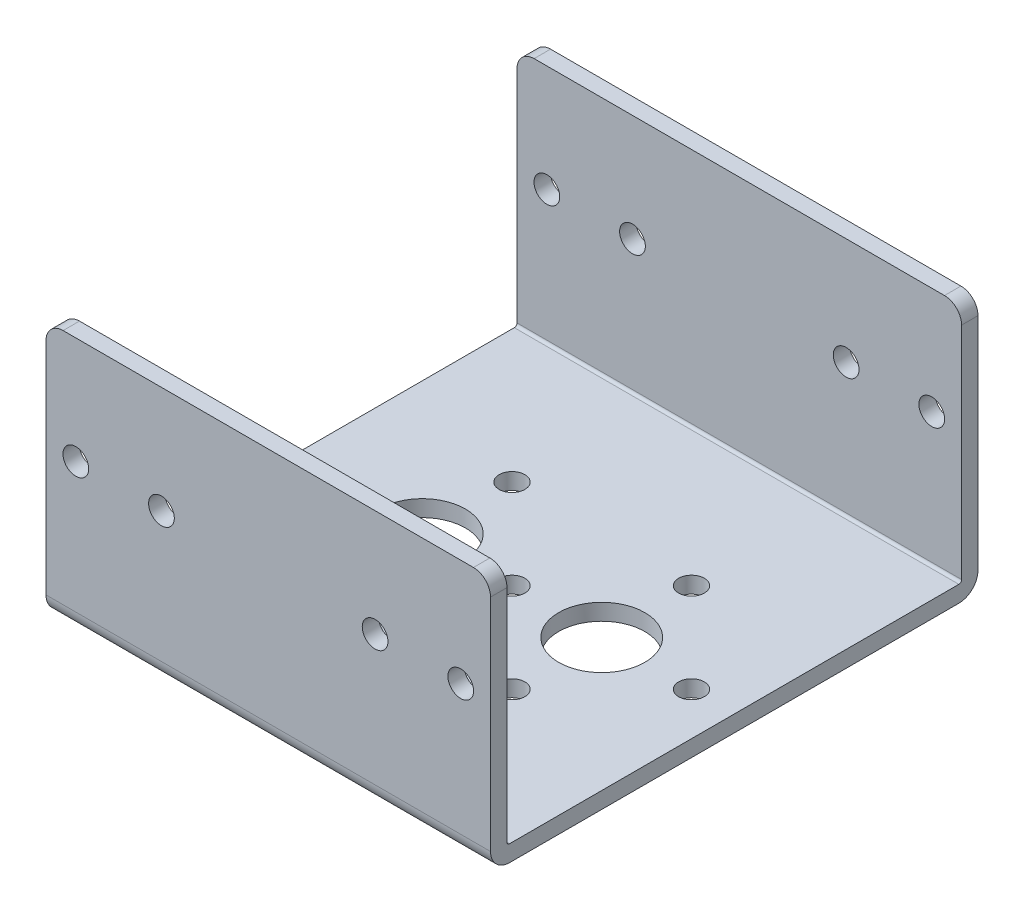
ISO-10303-21;
HEADER;
FILE_DESCRIPTION(('STEP AP214'),'2;1');
FILE_NAME('part.step','',(''),(''),'','','');
FILE_SCHEMA(('AUTOMOTIVE_DESIGN { 1 0 10303 214 1 1 1 1 }'));
ENDSEC;
DATA;
#1=APPLICATION_CONTEXT('core data for automotive mechanical design processes');
#2=APPLICATION_PROTOCOL_DEFINITION('international standard','automotive_design',2000,#1);
#3=PRODUCT_CONTEXT('',#1,'mechanical');
#4=PRODUCT('Part','Part','',(#3));
#5=PRODUCT_RELATED_PRODUCT_CATEGORY('part','',(#4));
#6=PRODUCT_DEFINITION_FORMATION('','',#4);
#7=PRODUCT_DEFINITION_CONTEXT('part definition',#1,'design');
#8=PRODUCT_DEFINITION('design','',#6,#7);
#9=PRODUCT_DEFINITION_SHAPE('','',#8);
#10=(LENGTH_UNIT() NAMED_UNIT(*) SI_UNIT(.MILLI.,.METRE.));
#11=(NAMED_UNIT(*) PLANE_ANGLE_UNIT() SI_UNIT($,.RADIAN.));
#12=(NAMED_UNIT(*) SI_UNIT($,.STERADIAN.) SOLID_ANGLE_UNIT());
#13=UNCERTAINTY_MEASURE_WITH_UNIT(LENGTH_MEASURE(1.E-05),#10,'distance_accuracy_value','');
#14=(GEOMETRIC_REPRESENTATION_CONTEXT(3) GLOBAL_UNCERTAINTY_ASSIGNED_CONTEXT((#13)) GLOBAL_UNIT_ASSIGNED_CONTEXT((#10,
#11,#12)) REPRESENTATION_CONTEXT('',''));
#15=CARTESIAN_POINT('',(0.,0.,0.));
#16=DIRECTION('',(0.,0.,1.));
#17=DIRECTION('',(1.,0.,0.));
#18=AXIS2_PLACEMENT_3D('',#15,#16,#17);
#19=CARTESIAN_POINT('',(20.6375,0.,20.85086));
#20=DIRECTION('',(0.,1.,0.));
#21=DIRECTION('',(0.,0.,1.));
#22=AXIS2_PLACEMENT_3D('',#19,#20,#21);
#23=PLANE('',#22);
#24=CARTESIAN_POINT('',(0.,0.,0.));
#25=DIRECTION('',(0.,1.,0.));
#26=DIRECTION('',(0.,0.,1.));
#27=AXIS2_PLACEMENT_3D('',#24,#25,#26);
#28=CIRCLE('',#27,1.1938);
#29=CARTESIAN_POINT('',(0.,0.,1.1938));
#30=VERTEX_POINT('',#29);
#31=EDGE_CURVE('E265',#30,#30,#28,.T.);
#32=ORIENTED_EDGE('',*,*,#31,.T.);
#33=EDGE_LOOP('',(#32));
#34=FACE_BOUND('',#33,.T.);
#35=CARTESIAN_POINT('',(8.3312,0.,8.3312));
#36=DIRECTION('',(0.,1.,0.));
#37=DIRECTION('',(0.,0.,1.));
#38=AXIS2_PLACEMENT_3D('',#35,#36,#37);
#39=CIRCLE('',#38,1.1938);
#40=CARTESIAN_POINT('',(8.3312,0.,9.525));
#41=VERTEX_POINT('',#40);
#42=EDGE_CURVE('E261',#41,#41,#39,.T.);
#43=ORIENTED_EDGE('',*,*,#42,.T.);
#44=EDGE_LOOP('',(#43));
#45=FACE_BOUND('',#44,.T.);
#46=CARTESIAN_POINT('',(-8.3312,0.,-8.33119999999999));
#47=DIRECTION('',(0.,1.,0.));
#48=DIRECTION('',(0.,0.,1.));
#49=AXIS2_PLACEMENT_3D('',#46,#47,#48);
#50=CIRCLE('',#49,1.1938);
#51=CARTESIAN_POINT('',(-8.3312,0.,-7.13739999999999));
#52=VERTEX_POINT('',#51);
#53=EDGE_CURVE('E249',#52,#52,#50,.F.);
#54=ORIENTED_EDGE('',*,*,#53,.F.);
#55=EDGE_LOOP('',(#54));
#56=FACE_BOUND('',#55,.T.);
#57=CARTESIAN_POINT('',(-8.3312,0.,0.));
#58=DIRECTION('',(0.,1.,0.));
#59=DIRECTION('',(0.,0.,1.));
#60=AXIS2_PLACEMENT_3D('',#57,#58,#59);
#61=CIRCLE('',#60,4.0005);
#62=CARTESIAN_POINT('',(-8.3312,0.,4.0005));
#63=VERTEX_POINT('',#62);
#64=EDGE_CURVE('E164',#63,#63,#61,.F.);
#65=ORIENTED_EDGE('',*,*,#64,.F.);
#66=EDGE_LOOP('',(#65));
#67=FACE_BOUND('',#66,.T.);
#68=DIRECTION('',(-1.,0.,0.));
#69=VECTOR('',#68,1.);
#70=CARTESIAN_POINT('',(20.6375,0.,20.85086));
#71=LINE('',#70,#69);
#72=CARTESIAN_POINT('',(20.6375,0.,20.85086));
#73=VERTEX_POINT('',#72);
#74=CARTESIAN_POINT('',(-20.6375,0.,20.85086));
#75=VERTEX_POINT('',#74);
#76=EDGE_CURVE('E140',#73,#75,#71,.T.);
#77=ORIENTED_EDGE('',*,*,#76,.T.);
#78=DIRECTION('',(0.,0.,-1.));
#79=VECTOR('',#78,1.);
#80=CARTESIAN_POINT('',(-20.6375,0.,20.85086));
#81=LINE('',#80,#79);
#82=CARTESIAN_POINT('',(-20.6375,0.,-20.85086));
#83=VERTEX_POINT('',#82);
#84=EDGE_CURVE('E144',#75,#83,#81,.T.);
#85=ORIENTED_EDGE('',*,*,#84,.T.);
#86=DIRECTION('',(-1.,0.,0.));
#87=VECTOR('',#86,1.);
#88=CARTESIAN_POINT('',(20.6375,0.,-20.85086));
#89=LINE('',#88,#87);
#90=CARTESIAN_POINT('',(20.6375,0.,-20.85086));
#91=VERTEX_POINT('',#90);
#92=EDGE_CURVE('E151',#91,#83,#89,.T.);
#93=ORIENTED_EDGE('',*,*,#92,.F.);
#94=DIRECTION('',(0.,0.,-1.));
#95=VECTOR('',#94,1.);
#96=CARTESIAN_POINT('',(20.6375,0.,20.85086));
#97=LINE('',#96,#95);
#98=EDGE_CURVE('E145',#73,#91,#97,.T.);
#99=ORIENTED_EDGE('',*,*,#98,.F.);
#100=EDGE_LOOP('',(#77,#85,#93,#99));
#101=FACE_BOUND('',#100,.T.);
#102=CARTESIAN_POINT('',(8.3312,0.,0.));
#103=DIRECTION('',(0.,1.,0.));
#104=DIRECTION('',(0.,0.,1.));
#105=AXIS2_PLACEMENT_3D('',#102,#103,#104);
#106=CIRCLE('',#105,4.0005);
#107=CARTESIAN_POINT('',(8.3312,0.,4.0005));
#108=VERTEX_POINT('',#107);
#109=EDGE_CURVE('E237',#108,#108,#106,.T.);
#110=ORIENTED_EDGE('',*,*,#109,.T.);
#111=EDGE_LOOP('',(#110));
#112=FACE_BOUND('',#111,.T.);
#113=CARTESIAN_POINT('',(16.6624,0.,0.));
#114=DIRECTION('',(0.,1.,0.));
#115=DIRECTION('',(0.,0.,1.));
#116=AXIS2_PLACEMENT_3D('',#113,#114,#115);
#117=CIRCLE('',#116,1.1938);
#118=CARTESIAN_POINT('',(16.6624,0.,1.1938));
#119=VERTEX_POINT('',#118);
#120=EDGE_CURVE('E241',#119,#119,#117,.T.);
#121=ORIENTED_EDGE('',*,*,#120,.T.);
#122=EDGE_LOOP('',(#121));
#123=FACE_BOUND('',#122,.T.);
#124=CARTESIAN_POINT('',(-16.6624,0.,0.));
#125=DIRECTION('',(0.,1.,0.));
#126=DIRECTION('',(0.,0.,1.));
#127=AXIS2_PLACEMENT_3D('',#124,#125,#126);
#128=CIRCLE('',#127,1.1938);
#129=CARTESIAN_POINT('',(-16.6624,0.,1.1938));
#130=VERTEX_POINT('',#129);
#131=EDGE_CURVE('E245',#130,#130,#128,.F.);
#132=ORIENTED_EDGE('',*,*,#131,.F.);
#133=EDGE_LOOP('',(#132));
#134=FACE_BOUND('',#133,.T.);
#135=CARTESIAN_POINT('',(8.3312,0.,-8.3312));
#136=DIRECTION('',(0.,1.,0.));
#137=DIRECTION('',(0.,0.,1.));
#138=AXIS2_PLACEMENT_3D('',#135,#136,#137);
#139=CIRCLE('',#138,1.1938);
#140=CARTESIAN_POINT('',(8.3312,0.,-7.1374));
#141=VERTEX_POINT('',#140);
#142=EDGE_CURVE('E253',#141,#141,#139,.T.);
#143=ORIENTED_EDGE('',*,*,#142,.T.);
#144=EDGE_LOOP('',(#143));
#145=FACE_BOUND('',#144,.T.);
#146=CARTESIAN_POINT('',(-8.3312,0.,8.33119999999999));
#147=DIRECTION('',(0.,1.,0.));
#148=DIRECTION('',(0.,0.,1.));
#149=AXIS2_PLACEMENT_3D('',#146,#147,#148);
#150=CIRCLE('',#149,1.1938);
#151=CARTESIAN_POINT('',(-8.3312,0.,9.52499999999999));
#152=VERTEX_POINT('',#151);
#153=EDGE_CURVE('E257',#152,#152,#150,.F.);
#154=ORIENTED_EDGE('',*,*,#153,.F.);
#155=EDGE_LOOP('',(#154));
#156=FACE_BOUND('',#155,.T.);
#157=ADVANCED_FACE('F26',(#34,#45,#56,#67,#101,#112,#123,#134,#145,#156),#23,.F.);
#158=CARTESIAN_POINT('',(20.6375,1.524,-20.85086));
#159=DIRECTION('',(0.,-1.,0.));
#160=DIRECTION('',(0.,0.,-1.));
#161=AXIS2_PLACEMENT_3D('',#158,#159,#160);
#162=PLANE('',#161);
#163=CARTESIAN_POINT('',(0.,1.524,0.));
#164=DIRECTION('',(0.,-1.,0.));
#165=DIRECTION('',(0.,0.,-1.));
#166=AXIS2_PLACEMENT_3D('',#163,#164,#165);
#167=CIRCLE('',#166,1.1938);
#168=CARTESIAN_POINT('',(0.,1.524,-1.1938));
#169=VERTEX_POINT('',#168);
#170=EDGE_CURVE('E266',#169,#169,#167,.T.);
#171=ORIENTED_EDGE('',*,*,#170,.T.);
#172=EDGE_LOOP('',(#171));
#173=FACE_BOUND('',#172,.T.);
#174=CARTESIAN_POINT('',(8.3312,1.524,8.3312));
#175=DIRECTION('',(0.,-1.,0.));
#176=DIRECTION('',(0.,0.,-1.));
#177=AXIS2_PLACEMENT_3D('',#174,#175,#176);
#178=CIRCLE('',#177,1.1938);
#179=CARTESIAN_POINT('',(8.3312,1.524,7.1374));
#180=VERTEX_POINT('',#179);
#181=EDGE_CURVE('E262',#180,#180,#178,.T.);
#182=ORIENTED_EDGE('',*,*,#181,.T.);
#183=EDGE_LOOP('',(#182));
#184=FACE_BOUND('',#183,.T.);
#185=CARTESIAN_POINT('',(-8.3312,1.524,-8.33119999999999));
#186=DIRECTION('',(0.,-1.,0.));
#187=DIRECTION('',(0.,0.,-1.));
#188=AXIS2_PLACEMENT_3D('',#185,#186,#187);
#189=CIRCLE('',#188,1.1938);
#190=CARTESIAN_POINT('',(-8.3312,1.524,-9.52499999999999));
#191=VERTEX_POINT('',#190);
#192=EDGE_CURVE('E250',#191,#191,#189,.F.);
#193=ORIENTED_EDGE('',*,*,#192,.F.);
#194=EDGE_LOOP('',(#193));
#195=FACE_BOUND('',#194,.T.);
#196=CARTESIAN_POINT('',(-8.3312,1.524,0.));
#197=DIRECTION('',(0.,-1.,0.));
#198=DIRECTION('',(0.,0.,-1.));
#199=AXIS2_PLACEMENT_3D('',#196,#197,#198);
#200=CIRCLE('',#199,4.0005);
#201=CARTESIAN_POINT('',(-8.3312,1.524,-4.0005));
#202=VERTEX_POINT('',#201);
#203=EDGE_CURVE('E167',#202,#202,#200,.F.);
#204=ORIENTED_EDGE('',*,*,#203,.F.);
#205=EDGE_LOOP('',(#204));
#206=FACE_BOUND('',#205,.T.);
#207=DIRECTION('',(-1.,0.,0.));
#208=VECTOR('',#207,1.);
#209=CARTESIAN_POINT('',(20.6375,1.524,-20.85086));
#210=LINE('',#209,#208);
#211=CARTESIAN_POINT('',(20.6375,1.524,-20.85086));
#212=VERTEX_POINT('',#211);
#213=CARTESIAN_POINT('',(-20.6375,1.524,-20.85086));
#214=VERTEX_POINT('',#213);
#215=EDGE_CURVE('E222',#212,#214,#210,.T.);
#216=ORIENTED_EDGE('',*,*,#215,.T.);
#217=DIRECTION('',(0.,0.,1.));
#218=VECTOR('',#217,1.);
#219=CARTESIAN_POINT('',(-20.6375,1.524,-20.85086));
#220=LINE('',#219,#218);
#221=CARTESIAN_POINT('',(-20.6375,1.524,20.85086));
#222=VERTEX_POINT('',#221);
#223=EDGE_CURVE('E179',#214,#222,#220,.T.);
#224=ORIENTED_EDGE('',*,*,#223,.T.);
#225=DIRECTION('',(-1.,0.,0.));
#226=VECTOR('',#225,1.);
#227=CARTESIAN_POINT('',(20.6375,1.524,20.85086));
#228=LINE('',#227,#226);
#229=CARTESIAN_POINT('',(20.6375,1.524,20.85086));
#230=VERTEX_POINT('',#229);
#231=EDGE_CURVE('E220',#230,#222,#228,.T.);
#232=ORIENTED_EDGE('',*,*,#231,.F.);
#233=DIRECTION('',(0.,0.,1.));
#234=VECTOR('',#233,1.);
#235=CARTESIAN_POINT('',(20.6375,1.524,-20.85086));
#236=LINE('',#235,#234);
#237=EDGE_CURVE('E202',#212,#230,#236,.T.);
#238=ORIENTED_EDGE('',*,*,#237,.F.);
#239=EDGE_LOOP('',(#216,#224,#232,#238));
#240=FACE_BOUND('',#239,.T.);
#241=CARTESIAN_POINT('',(8.3312,1.524,0.));
#242=DIRECTION('',(0.,-1.,0.));
#243=DIRECTION('',(0.,0.,-1.));
#244=AXIS2_PLACEMENT_3D('',#241,#242,#243);
#245=CIRCLE('',#244,4.0005);
#246=CARTESIAN_POINT('',(8.3312,1.524,-4.0005));
#247=VERTEX_POINT('',#246);
#248=EDGE_CURVE('E238',#247,#247,#245,.T.);
#249=ORIENTED_EDGE('',*,*,#248,.T.);
#250=EDGE_LOOP('',(#249));
#251=FACE_BOUND('',#250,.T.);
#252=CARTESIAN_POINT('',(16.6624,1.524,0.));
#253=DIRECTION('',(0.,-1.,0.));
#254=DIRECTION('',(0.,0.,-1.));
#255=AXIS2_PLACEMENT_3D('',#252,#253,#254);
#256=CIRCLE('',#255,1.1938);
#257=CARTESIAN_POINT('',(16.6624,1.524,-1.1938));
#258=VERTEX_POINT('',#257);
#259=EDGE_CURVE('E242',#258,#258,#256,.T.);
#260=ORIENTED_EDGE('',*,*,#259,.T.);
#261=EDGE_LOOP('',(#260));
#262=FACE_BOUND('',#261,.T.);
#263=CARTESIAN_POINT('',(-16.6624,1.524,0.));
#264=DIRECTION('',(0.,-1.,0.));
#265=DIRECTION('',(0.,0.,-1.));
#266=AXIS2_PLACEMENT_3D('',#263,#264,#265);
#267=CIRCLE('',#266,1.1938);
#268=CARTESIAN_POINT('',(-16.6624,1.524,-1.1938));
#269=VERTEX_POINT('',#268);
#270=EDGE_CURVE('E246',#269,#269,#267,.F.);
#271=ORIENTED_EDGE('',*,*,#270,.F.);
#272=EDGE_LOOP('',(#271));
#273=FACE_BOUND('',#272,.T.);
#274=CARTESIAN_POINT('',(8.3312,1.524,-8.3312));
#275=DIRECTION('',(0.,-1.,0.));
#276=DIRECTION('',(0.,0.,-1.));
#277=AXIS2_PLACEMENT_3D('',#274,#275,#276);
#278=CIRCLE('',#277,1.1938);
#279=CARTESIAN_POINT('',(8.3312,1.524,-9.525));
#280=VERTEX_POINT('',#279);
#281=EDGE_CURVE('E254',#280,#280,#278,.T.);
#282=ORIENTED_EDGE('',*,*,#281,.T.);
#283=EDGE_LOOP('',(#282));
#284=FACE_BOUND('',#283,.T.);
#285=CARTESIAN_POINT('',(-8.3312,1.524,8.33119999999999));
#286=DIRECTION('',(0.,-1.,0.));
#287=DIRECTION('',(0.,0.,-1.));
#288=AXIS2_PLACEMENT_3D('',#285,#286,#287);
#289=CIRCLE('',#288,1.1938);
#290=CARTESIAN_POINT('',(-8.3312,1.524,7.13739999999999));
#291=VERTEX_POINT('',#290);
#292=EDGE_CURVE('E258',#291,#291,#289,.F.);
#293=ORIENTED_EDGE('',*,*,#292,.F.);
#294=EDGE_LOOP('',(#293));
#295=FACE_BOUND('',#294,.T.);
#296=ADVANCED_FACE('F332',(#173,#184,#195,#206,#240,#251,#262,#273,#284,#295),#162,.F.);
#297=CARTESIAN_POINT('',(20.6375,1.778,20.85086));
#298=DIRECTION('',(-1.,0.,0.));
#299=DIRECTION('',(0.,0.,1.));
#300=AXIS2_PLACEMENT_3D('',#297,#298,#299);
#301=CYLINDRICAL_SURFACE('',#300,1.778);
#302=DIRECTION('',(-1.,0.,0.));
#303=VECTOR('',#302,1.);
#304=CARTESIAN_POINT('',(20.6375,1.77800000000001,22.62886));
#305=LINE('',#304,#303);
#306=CARTESIAN_POINT('',(20.6375,1.77800000000001,22.62886));
#307=VERTEX_POINT('',#306);
#308=CARTESIAN_POINT('',(-20.6375,1.77800000000001,22.62886));
#309=VERTEX_POINT('',#308);
#310=EDGE_CURVE('E163',#307,#309,#305,.T.);
#311=ORIENTED_EDGE('',*,*,#310,.T.);
#312=CARTESIAN_POINT('',(-20.6375,1.778,20.85086));
#313=DIRECTION('',(1.,0.,0.));
#314=DIRECTION('',(0.,0.,1.));
#315=AXIS2_PLACEMENT_3D('',#312,#313,#314);
#316=CIRCLE('',#315,1.778);
#317=EDGE_CURVE('E157',#309,#75,#316,.T.);
#318=ORIENTED_EDGE('',*,*,#317,.T.);
#319=ORIENTED_EDGE('',*,*,#76,.F.);
#320=CARTESIAN_POINT('',(20.6375,1.778,20.85086));
#321=DIRECTION('',(1.,0.,0.));
#322=DIRECTION('',(0.,0.,1.));
#323=AXIS2_PLACEMENT_3D('',#320,#321,#322);
#324=CIRCLE('',#323,1.778);
#325=EDGE_CURVE('E190',#307,#73,#324,.T.);
#326=ORIENTED_EDGE('',*,*,#325,.F.);
#327=EDGE_LOOP('',(#311,#318,#319,#326));
#328=FACE_BOUND('',#327,.T.);
#329=ADVANCED_FACE('F28',(#328),#301,.T.);
#330=CARTESIAN_POINT('',(20.6375,1.778,-20.85086));
#331=DIRECTION('',(-1.,0.,0.));
#332=DIRECTION('',(0.,0.,1.));
#333=AXIS2_PLACEMENT_3D('',#330,#331,#332);
#334=CYLINDRICAL_SURFACE('',#333,1.778);
#335=ORIENTED_EDGE('',*,*,#92,.T.);
#336=CARTESIAN_POINT('',(-20.6375,1.778,-20.85086));
#337=DIRECTION('',(1.,0.,0.));
#338=DIRECTION('',(0.,0.,1.));
#339=AXIS2_PLACEMENT_3D('',#336,#337,#338);
#340=CIRCLE('',#339,1.778);
#341=CARTESIAN_POINT('',(-20.6375,1.77800000000001,-22.62886));
#342=VERTEX_POINT('',#341);
#343=EDGE_CURVE('E159',#83,#342,#340,.T.);
#344=ORIENTED_EDGE('',*,*,#343,.T.);
#345=DIRECTION('',(-1.,0.,0.));
#346=VECTOR('',#345,1.);
#347=CARTESIAN_POINT('',(20.6375,1.77800000000001,-22.62886));
#348=LINE('',#347,#346);
#349=CARTESIAN_POINT('',(20.6375,1.77800000000001,-22.62886));
#350=VERTEX_POINT('',#349);
#351=EDGE_CURVE('E232',#350,#342,#348,.T.);
#352=ORIENTED_EDGE('',*,*,#351,.F.);
#353=CARTESIAN_POINT('',(20.6375,1.778,-20.85086));
#354=DIRECTION('',(1.,0.,0.));
#355=DIRECTION('',(0.,0.,1.));
#356=AXIS2_PLACEMENT_3D('',#353,#354,#355);
#357=CIRCLE('',#356,1.778);
#358=EDGE_CURVE('E193',#91,#350,#357,.T.);
#359=ORIENTED_EDGE('',*,*,#358,.F.);
#360=EDGE_LOOP('',(#335,#344,#352,#359));
#361=FACE_BOUND('',#360,.T.);
#362=ADVANCED_FACE('F358',(#361),#334,.T.);
#363=CARTESIAN_POINT('',(20.6375,1.77800000000001,-22.62886));
#364=DIRECTION('',(0.,0.,1.));
#365=DIRECTION('',(1.,0.,0.));
#366=AXIS2_PLACEMENT_3D('',#363,#364,#365);
#367=PLANE('',#366);
#368=CARTESIAN_POINT('',(17.8689,13.8938,-22.62886));
#369=DIRECTION('',(0.,0.,1.));
#370=DIRECTION('',(-1.,0.,0.));
#371=AXIS2_PLACEMENT_3D('',#368,#369,#370);
#372=CIRCLE('',#371,1.1938);
#373=CARTESIAN_POINT('',(16.6751,13.8938,-22.62886));
#374=VERTEX_POINT('',#373);
#375=EDGE_CURVE('E592',#374,#374,#372,.T.);
#376=ORIENTED_EDGE('',*,*,#375,.T.);
#377=EDGE_LOOP('',(#376));
#378=FACE_BOUND('',#377,.T.);
#379=CARTESIAN_POINT('',(9.9187,13.8938,-22.62886));
#380=DIRECTION('',(0.,0.,1.));
#381=DIRECTION('',(-1.,0.,0.));
#382=AXIS2_PLACEMENT_3D('',#379,#380,#381);
#383=CIRCLE('',#382,1.1938);
#384=CARTESIAN_POINT('',(8.7249,13.8938,-22.62886));
#385=VERTEX_POINT('',#384);
#386=EDGE_CURVE('E580',#385,#385,#383,.T.);
#387=ORIENTED_EDGE('',*,*,#386,.T.);
#388=EDGE_LOOP('',(#387));
#389=FACE_BOUND('',#388,.T.);
#390=CARTESIAN_POINT('',(-9.9187,13.8938,-22.62886));
#391=DIRECTION('',(0.,0.,1.));
#392=DIRECTION('',(1.,0.,0.));
#393=AXIS2_PLACEMENT_3D('',#390,#391,#392);
#394=CIRCLE('',#393,1.1938);
#395=CARTESIAN_POINT('',(-8.7249,13.8938,-22.62886));
#396=VERTEX_POINT('',#395);
#397=EDGE_CURVE('E568',#396,#396,#394,.T.);
#398=ORIENTED_EDGE('',*,*,#397,.T.);
#399=EDGE_LOOP('',(#398));
#400=FACE_BOUND('',#399,.T.);
#401=CARTESIAN_POINT('',(-17.8689,13.8938,-22.62886));
#402=DIRECTION('',(0.,0.,1.));
#403=DIRECTION('',(1.,0.,0.));
#404=AXIS2_PLACEMENT_3D('',#401,#402,#403);
#405=CIRCLE('',#404,1.1938);
#406=CARTESIAN_POINT('',(-16.6751,13.8938,-22.62886));
#407=VERTEX_POINT('',#406);
#408=EDGE_CURVE('E556',#407,#407,#405,.T.);
#409=ORIENTED_EDGE('',*,*,#408,.T.);
#410=EDGE_LOOP('',(#409));
#411=FACE_BOUND('',#410,.T.);
#412=DIRECTION('',(-1.,0.,0.));
#413=VECTOR('',#412,1.);
#414=CARTESIAN_POINT('',(20.6375,23.8252,-22.62886));
#415=LINE('',#414,#413);
#416=CARTESIAN_POINT('',(19.05,23.8252,-22.62886));
#417=VERTEX_POINT('',#416);
#418=CARTESIAN_POINT('',(-19.05,23.8252,-22.62886));
#419=VERTEX_POINT('',#418);
#420=EDGE_CURVE('E230',#417,#419,#415,.T.);
#421=ORIENTED_EDGE('',*,*,#420,.F.);
#422=CARTESIAN_POINT('',(19.05,22.2377,-22.62886));
#423=DIRECTION('',(0.,0.,1.));
#424=DIRECTION('',(1.,0.,0.));
#425=AXIS2_PLACEMENT_3D('',#422,#423,#424);
#426=CIRCLE('',#425,1.5875);
#427=CARTESIAN_POINT('',(20.6375,22.2377,-22.62886));
#428=VERTEX_POINT('',#427);
#429=EDGE_CURVE('E298',#417,#428,#426,.F.);
#430=ORIENTED_EDGE('',*,*,#429,.T.);
#431=DIRECTION('',(0.,1.,0.));
#432=VECTOR('',#431,1.);
#433=CARTESIAN_POINT('',(20.6375,1.77800000000001,-22.62886));
#434=LINE('',#433,#432);
#435=EDGE_CURVE('E195',#350,#428,#434,.T.);
#436=ORIENTED_EDGE('',*,*,#435,.F.);
#437=ORIENTED_EDGE('',*,*,#351,.T.);
#438=DIRECTION('',(0.,1.,0.));
#439=VECTOR('',#438,1.);
#440=CARTESIAN_POINT('',(-20.6375,1.77800000000001,-22.62886));
#441=LINE('',#440,#439);
#442=CARTESIAN_POINT('',(-20.6375,22.2377,-22.62886));
#443=VERTEX_POINT('',#442);
#444=EDGE_CURVE('E172',#342,#443,#441,.T.);
#445=ORIENTED_EDGE('',*,*,#444,.T.);
#446=CARTESIAN_POINT('',(-19.05,22.2377,-22.62886));
#447=DIRECTION('',(0.,0.,1.));
#448=DIRECTION('',(1.,0.,0.));
#449=AXIS2_PLACEMENT_3D('',#446,#447,#448);
#450=CIRCLE('',#449,1.5875);
#451=EDGE_CURVE('E47',#443,#419,#450,.F.);
#452=ORIENTED_EDGE('',*,*,#451,.T.);
#453=EDGE_LOOP('',(#421,#430,#436,#437,#445,#452));
#454=FACE_BOUND('',#453,.T.);
#455=ADVANCED_FACE('F301',(#378,#389,#400,#411,#454),#367,.F.);
#456=CARTESIAN_POINT('',(20.6375,23.8252,-22.62886));
#457=DIRECTION('',(0.,-1.,0.));
#458=DIRECTION('',(0.,0.,-1.));
#459=AXIS2_PLACEMENT_3D('',#456,#457,#458);
#460=PLANE('',#459);
#461=DIRECTION('',(-1.,0.,0.));
#462=VECTOR('',#461,1.);
#463=CARTESIAN_POINT('',(20.6375,23.8252,-21.10486));
#464=LINE('',#463,#462);
#465=CARTESIAN_POINT('',(19.05,23.8252,-21.10486));
#466=VERTEX_POINT('',#465);
#467=CARTESIAN_POINT('',(-19.05,23.8252,-21.10486));
#468=VERTEX_POINT('',#467);
#469=EDGE_CURVE('E227',#466,#468,#464,.T.);
#470=ORIENTED_EDGE('',*,*,#469,.F.);
#471=DIRECTION('',(0.,0.,1.));
#472=VECTOR('',#471,1.);
#473=CARTESIAN_POINT('',(19.05,23.8252,-22.62886));
#474=LINE('',#473,#472);
#475=EDGE_CURVE('E295',#466,#417,#474,.F.);
#476=ORIENTED_EDGE('',*,*,#475,.T.);
#477=ORIENTED_EDGE('',*,*,#420,.T.);
#478=DIRECTION('',(0.,0.,1.));
#479=VECTOR('',#478,1.);
#480=CARTESIAN_POINT('',(-19.05,23.8252,-21.10486));
#481=LINE('',#480,#479);
#482=EDGE_CURVE('E292',#419,#468,#481,.T.);
#483=ORIENTED_EDGE('',*,*,#482,.T.);
#484=EDGE_LOOP('',(#470,#476,#477,#483));
#485=FACE_BOUND('',#484,.T.);
#486=ADVANCED_FACE('F316',(#485),#460,.F.);
#487=CARTESIAN_POINT('',(20.6375,23.8252,-21.10486));
#488=DIRECTION('',(0.,0.,-1.));
#489=DIRECTION('',(-1.,0.,0.));
#490=AXIS2_PLACEMENT_3D('',#487,#488,#489);
#491=PLANE('',#490);
#492=CARTESIAN_POINT('',(17.8689,13.8938,-21.10486));
#493=DIRECTION('',(0.,0.,-1.));
#494=DIRECTION('',(-1.,0.,0.));
#495=AXIS2_PLACEMENT_3D('',#492,#493,#494);
#496=CIRCLE('',#495,1.1938);
#497=CARTESIAN_POINT('',(16.6751,13.8938,-21.10486));
#498=VERTEX_POINT('',#497);
#499=EDGE_CURVE('E586',#498,#498,#496,.T.);
#500=ORIENTED_EDGE('',*,*,#499,.T.);
#501=EDGE_LOOP('',(#500));
#502=FACE_BOUND('',#501,.T.);
#503=CARTESIAN_POINT('',(9.9187,13.8938,-21.10486));
#504=DIRECTION('',(0.,0.,-1.));
#505=DIRECTION('',(-1.,0.,0.));
#506=AXIS2_PLACEMENT_3D('',#503,#504,#505);
#507=CIRCLE('',#506,1.1938);
#508=CARTESIAN_POINT('',(8.7249,13.8938,-21.10486));
#509=VERTEX_POINT('',#508);
#510=EDGE_CURVE('E574',#509,#509,#507,.T.);
#511=ORIENTED_EDGE('',*,*,#510,.T.);
#512=EDGE_LOOP('',(#511));
#513=FACE_BOUND('',#512,.T.);
#514=CARTESIAN_POINT('',(-9.9187,13.8938,-21.10486));
#515=DIRECTION('',(0.,0.,-1.));
#516=DIRECTION('',(-1.,0.,0.));
#517=AXIS2_PLACEMENT_3D('',#514,#515,#516);
#518=CIRCLE('',#517,1.1938);
#519=CARTESIAN_POINT('',(-11.1125,13.8938,-21.10486));
#520=VERTEX_POINT('',#519);
#521=EDGE_CURVE('E562',#520,#520,#518,.T.);
#522=ORIENTED_EDGE('',*,*,#521,.T.);
#523=EDGE_LOOP('',(#522));
#524=FACE_BOUND('',#523,.T.);
#525=CARTESIAN_POINT('',(-17.8689,13.8938,-21.10486));
#526=DIRECTION('',(0.,0.,-1.));
#527=DIRECTION('',(-1.,0.,0.));
#528=AXIS2_PLACEMENT_3D('',#525,#526,#527);
#529=CIRCLE('',#528,1.1938);
#530=CARTESIAN_POINT('',(-19.0627,13.8938,-21.10486));
#531=VERTEX_POINT('',#530);
#532=EDGE_CURVE('E269',#531,#531,#529,.T.);
#533=ORIENTED_EDGE('',*,*,#532,.T.);
#534=EDGE_LOOP('',(#533));
#535=FACE_BOUND('',#534,.T.);
#536=DIRECTION('',(0.,-1.,0.));
#537=VECTOR('',#536,1.);
#538=CARTESIAN_POINT('',(20.6375,23.8252,-21.10486));
#539=LINE('',#538,#537);
#540=CARTESIAN_POINT('',(20.6375,22.2377,-21.10486));
#541=VERTEX_POINT('',#540);
#542=CARTESIAN_POINT('',(20.6375,1.77800000000001,-21.10486));
#543=VERTEX_POINT('',#542);
#544=EDGE_CURVE('E198',#541,#543,#539,.T.);
#545=ORIENTED_EDGE('',*,*,#544,.F.);
#546=CARTESIAN_POINT('',(19.05,22.2377,-21.10486));
#547=DIRECTION('',(0.,0.,-1.));
#548=DIRECTION('',(-1.,0.,0.));
#549=AXIS2_PLACEMENT_3D('',#546,#547,#548);
#550=CIRCLE('',#549,1.5875);
#551=EDGE_CURVE('E290',#541,#466,#550,.F.);
#552=ORIENTED_EDGE('',*,*,#551,.T.);
#553=ORIENTED_EDGE('',*,*,#469,.T.);
#554=CARTESIAN_POINT('',(-19.05,22.2377,-21.10486));
#555=DIRECTION('',(0.,0.,-1.));
#556=DIRECTION('',(-1.,0.,0.));
#557=AXIS2_PLACEMENT_3D('',#554,#555,#556);
#558=CIRCLE('',#557,1.5875);
#559=CARTESIAN_POINT('',(-20.6375,22.2377,-21.10486));
#560=VERTEX_POINT('',#559);
#561=EDGE_CURVE('E288',#468,#560,#558,.F.);
#562=ORIENTED_EDGE('',*,*,#561,.T.);
#563=DIRECTION('',(0.,-1.,0.));
#564=VECTOR('',#563,1.);
#565=CARTESIAN_POINT('',(-20.6375,23.8252,-21.10486));
#566=LINE('',#565,#564);
#567=CARTESIAN_POINT('',(-20.6375,1.77800000000001,-21.10486));
#568=VERTEX_POINT('',#567);
#569=EDGE_CURVE('E174',#560,#568,#566,.T.);
#570=ORIENTED_EDGE('',*,*,#569,.T.);
#571=DIRECTION('',(-1.,0.,0.));
#572=VECTOR('',#571,1.);
#573=CARTESIAN_POINT('',(20.6375,1.77800000000001,-21.10486));
#574=LINE('',#573,#572);
#575=EDGE_CURVE('E224',#543,#568,#574,.T.);
#576=ORIENTED_EDGE('',*,*,#575,.F.);
#577=EDGE_LOOP('',(#545,#552,#553,#562,#570,#576));
#578=FACE_BOUND('',#577,.T.);
#579=ADVANCED_FACE('F313',(#502,#513,#524,#535,#578),#491,.F.);
#580=CARTESIAN_POINT('',(20.6375,1.778,-20.85086));
#581=DIRECTION('',(-1.,0.,0.));
#582=DIRECTION('',(0.,0.,1.));
#583=AXIS2_PLACEMENT_3D('',#580,#581,#582);
#584=CYLINDRICAL_SURFACE('',#583,0.254);
#585=ORIENTED_EDGE('',*,*,#575,.T.);
#586=CARTESIAN_POINT('',(-20.6375,1.778,-20.85086));
#587=DIRECTION('',(-1.,0.,0.));
#588=DIRECTION('',(0.,0.,1.));
#589=AXIS2_PLACEMENT_3D('',#586,#587,#588);
#590=CIRCLE('',#589,0.254);
#591=EDGE_CURVE('E176',#568,#214,#590,.T.);
#592=ORIENTED_EDGE('',*,*,#591,.T.);
#593=ORIENTED_EDGE('',*,*,#215,.F.);
#594=CARTESIAN_POINT('',(20.6375,1.778,-20.85086));
#595=DIRECTION('',(-1.,0.,0.));
#596=DIRECTION('',(0.,0.,1.));
#597=AXIS2_PLACEMENT_3D('',#594,#595,#596);
#598=CIRCLE('',#597,0.254);
#599=EDGE_CURVE('E200',#543,#212,#598,.T.);
#600=ORIENTED_EDGE('',*,*,#599,.F.);
#601=EDGE_LOOP('',(#585,#592,#593,#600));
#602=FACE_BOUND('',#601,.T.);
#603=ADVANCED_FACE('F325',(#602),#584,.F.);
#604=CARTESIAN_POINT('',(20.6375,1.778,20.85086));
#605=DIRECTION('',(-1.,0.,0.));
#606=DIRECTION('',(0.,0.,1.));
#607=AXIS2_PLACEMENT_3D('',#604,#605,#606);
#608=CYLINDRICAL_SURFACE('',#607,0.254);
#609=ORIENTED_EDGE('',*,*,#231,.T.);
#610=CARTESIAN_POINT('',(-20.6375,1.778,20.85086));
#611=DIRECTION('',(-1.,0.,0.));
#612=DIRECTION('',(0.,0.,1.));
#613=AXIS2_PLACEMENT_3D('',#610,#611,#612);
#614=CIRCLE('',#613,0.254);
#615=CARTESIAN_POINT('',(-20.6375,1.778,21.10486));
#616=VERTEX_POINT('',#615);
#617=EDGE_CURVE('E182',#222,#616,#614,.T.);
#618=ORIENTED_EDGE('',*,*,#617,.T.);
#619=DIRECTION('',(-1.,0.,0.));
#620=VECTOR('',#619,1.);
#621=CARTESIAN_POINT('',(20.6375,1.778,21.10486));
#622=LINE('',#621,#620);
#623=CARTESIAN_POINT('',(20.6375,1.778,21.10486));
#624=VERTEX_POINT('',#623);
#625=EDGE_CURVE('E218',#624,#616,#622,.T.);
#626=ORIENTED_EDGE('',*,*,#625,.F.);
#627=CARTESIAN_POINT('',(20.6375,1.778,20.85086));
#628=DIRECTION('',(-1.,0.,0.));
#629=DIRECTION('',(0.,0.,1.));
#630=AXIS2_PLACEMENT_3D('',#627,#628,#629);
#631=CIRCLE('',#630,0.254);
#632=EDGE_CURVE('E204',#230,#624,#631,.T.);
#633=ORIENTED_EDGE('',*,*,#632,.F.);
#634=EDGE_LOOP('',(#609,#618,#626,#633));
#635=FACE_BOUND('',#634,.T.);
#636=ADVANCED_FACE('F335',(#635),#608,.F.);
#637=CARTESIAN_POINT('',(20.6375,23.8252,21.10486));
#638=DIRECTION('',(0.,0.,1.));
#639=DIRECTION('',(1.,0.,0.));
#640=AXIS2_PLACEMENT_3D('',#637,#638,#639);
#641=PLANE('',#640);
#642=CARTESIAN_POINT('',(17.8689,13.8938,21.10486));
#643=DIRECTION('',(0.,0.,1.));
#644=DIRECTION('',(1.,0.,0.));
#645=AXIS2_PLACEMENT_3D('',#642,#643,#644);
#646=CIRCLE('',#645,1.1938);
#647=CARTESIAN_POINT('',(19.0627,13.8938,21.10486));
#648=VERTEX_POINT('',#647);
#649=EDGE_CURVE('E589',#648,#648,#646,.T.);
#650=ORIENTED_EDGE('',*,*,#649,.T.);
#651=EDGE_LOOP('',(#650));
#652=FACE_BOUND('',#651,.T.);
#653=CARTESIAN_POINT('',(9.9187,13.8938,21.10486));
#654=DIRECTION('',(0.,0.,1.));
#655=DIRECTION('',(1.,0.,0.));
#656=AXIS2_PLACEMENT_3D('',#653,#654,#655);
#657=CIRCLE('',#656,1.1938);
#658=CARTESIAN_POINT('',(11.1125,13.8938,21.10486));
#659=VERTEX_POINT('',#658);
#660=EDGE_CURVE('E577',#659,#659,#657,.T.);
#661=ORIENTED_EDGE('',*,*,#660,.T.);
#662=EDGE_LOOP('',(#661));
#663=FACE_BOUND('',#662,.T.);
#664=CARTESIAN_POINT('',(-9.9187,13.8938,21.10486));
#665=DIRECTION('',(0.,0.,1.));
#666=DIRECTION('',(1.,0.,0.));
#667=AXIS2_PLACEMENT_3D('',#664,#665,#666);
#668=CIRCLE('',#667,1.1938);
#669=CARTESIAN_POINT('',(-8.7249,13.8938,21.10486));
#670=VERTEX_POINT('',#669);
#671=EDGE_CURVE('E565',#670,#670,#668,.T.);
#672=ORIENTED_EDGE('',*,*,#671,.T.);
#673=EDGE_LOOP('',(#672));
#674=FACE_BOUND('',#673,.T.);
#675=CARTESIAN_POINT('',(-17.8689,13.8938,21.10486));
#676=DIRECTION('',(0.,0.,1.));
#677=DIRECTION('',(1.,0.,0.));
#678=AXIS2_PLACEMENT_3D('',#675,#676,#677);
#679=CIRCLE('',#678,1.1938);
#680=CARTESIAN_POINT('',(-16.6751,13.8938,21.10486));
#681=VERTEX_POINT('',#680);
#682=EDGE_CURVE('E553',#681,#681,#679,.T.);
#683=ORIENTED_EDGE('',*,*,#682,.T.);
#684=EDGE_LOOP('',(#683));
#685=FACE_BOUND('',#684,.T.);
#686=DIRECTION('',(-1.,0.,0.));
#687=VECTOR('',#686,1.);
#688=CARTESIAN_POINT('',(20.6375,23.8252,21.10486));
#689=LINE('',#688,#687);
#690=CARTESIAN_POINT('',(19.05,23.8252,21.10486));
#691=VERTEX_POINT('',#690);
#692=CARTESIAN_POINT('',(-19.05,23.8252,21.10486));
#693=VERTEX_POINT('',#692);
#694=EDGE_CURVE('E215',#691,#693,#689,.T.);
#695=ORIENTED_EDGE('',*,*,#694,.F.);
#696=CARTESIAN_POINT('',(19.05,22.2377,21.10486));
#697=DIRECTION('',(0.,0.,1.));
#698=DIRECTION('',(1.,0.,0.));
#699=AXIS2_PLACEMENT_3D('',#696,#697,#698);
#700=CIRCLE('',#699,1.5875);
#701=CARTESIAN_POINT('',(20.6375,22.2377,21.10486));
#702=VERTEX_POINT('',#701);
#703=EDGE_CURVE('E286',#691,#702,#700,.F.);
#704=ORIENTED_EDGE('',*,*,#703,.T.);
#705=DIRECTION('',(0.,1.,0.));
#706=VECTOR('',#705,1.);
#707=CARTESIAN_POINT('',(20.6375,23.8252,21.10486));
#708=LINE('',#707,#706);
#709=EDGE_CURVE('E206',#624,#702,#708,.T.);
#710=ORIENTED_EDGE('',*,*,#709,.F.);
#711=ORIENTED_EDGE('',*,*,#625,.T.);
#712=DIRECTION('',(0.,1.,0.));
#713=VECTOR('',#712,1.);
#714=CARTESIAN_POINT('',(-20.6375,23.8252,21.10486));
#715=LINE('',#714,#713);
#716=CARTESIAN_POINT('',(-20.6375,22.2377,21.10486));
#717=VERTEX_POINT('',#716);
#718=EDGE_CURVE('E185',#616,#717,#715,.T.);
#719=ORIENTED_EDGE('',*,*,#718,.T.);
#720=CARTESIAN_POINT('',(-19.05,22.2377,21.10486));
#721=DIRECTION('',(0.,0.,1.));
#722=DIRECTION('',(1.,0.,0.));
#723=AXIS2_PLACEMENT_3D('',#720,#721,#722);
#724=CIRCLE('',#723,1.5875);
#725=EDGE_CURVE('E284',#717,#693,#724,.F.);
#726=ORIENTED_EDGE('',*,*,#725,.T.);
#727=EDGE_LOOP('',(#695,#704,#710,#711,#719,#726));
#728=FACE_BOUND('',#727,.T.);
#729=ADVANCED_FACE('F340',(#652,#663,#674,#685,#728),#641,.F.);
#730=CARTESIAN_POINT('',(20.6375,23.8252,22.62886));
#731=DIRECTION('',(0.,-1.,0.));
#732=DIRECTION('',(0.,0.,-1.));
#733=AXIS2_PLACEMENT_3D('',#730,#731,#732);
#734=PLANE('',#733);
#735=DIRECTION('',(-1.,0.,0.));
#736=VECTOR('',#735,1.);
#737=CARTESIAN_POINT('',(20.6375,23.8252,22.62886));
#738=LINE('',#737,#736);
#739=CARTESIAN_POINT('',(19.05,23.8252,22.62886));
#740=VERTEX_POINT('',#739);
#741=CARTESIAN_POINT('',(-19.05,23.8252,22.62886));
#742=VERTEX_POINT('',#741);
#743=EDGE_CURVE('E212',#740,#742,#738,.T.);
#744=ORIENTED_EDGE('',*,*,#743,.F.);
#745=DIRECTION('',(0.,0.,1.));
#746=VECTOR('',#745,1.);
#747=CARTESIAN_POINT('',(19.05,23.8252,22.62886));
#748=LINE('',#747,#746);
#749=EDGE_CURVE('E282',#740,#691,#748,.F.);
#750=ORIENTED_EDGE('',*,*,#749,.T.);
#751=ORIENTED_EDGE('',*,*,#694,.T.);
#752=DIRECTION('',(0.,0.,1.));
#753=VECTOR('',#752,1.);
#754=CARTESIAN_POINT('',(-19.05,23.8252,22.62886));
#755=LINE('',#754,#753);
#756=EDGE_CURVE('E279',#693,#742,#755,.T.);
#757=ORIENTED_EDGE('',*,*,#756,.T.);
#758=EDGE_LOOP('',(#744,#750,#751,#757));
#759=FACE_BOUND('',#758,.T.);
#760=ADVANCED_FACE('F351',(#759),#734,.F.);
#761=CARTESIAN_POINT('',(20.6375,1.77800000000001,22.62886));
#762=DIRECTION('',(0.,0.,-1.));
#763=DIRECTION('',(-1.,0.,0.));
#764=AXIS2_PLACEMENT_3D('',#761,#762,#763);
#765=PLANE('',#764);
#766=CARTESIAN_POINT('',(17.8689,13.8938,22.62886));
#767=DIRECTION('',(0.,0.,1.));
#768=DIRECTION('',(-1.,0.,0.));
#769=AXIS2_PLACEMENT_3D('',#766,#767,#768);
#770=CIRCLE('',#769,1.1938);
#771=CARTESIAN_POINT('',(16.6751,13.8938,22.62886));
#772=VERTEX_POINT('',#771);
#773=EDGE_CURVE('E595',#772,#772,#770,.T.);
#774=ORIENTED_EDGE('',*,*,#773,.F.);
#775=EDGE_LOOP('',(#774));
#776=FACE_BOUND('',#775,.T.);
#777=CARTESIAN_POINT('',(9.9187,13.8938,22.62886));
#778=DIRECTION('',(0.,0.,1.));
#779=DIRECTION('',(-1.,0.,0.));
#780=AXIS2_PLACEMENT_3D('',#777,#778,#779);
#781=CIRCLE('',#780,1.1938);
#782=CARTESIAN_POINT('',(8.7249,13.8938,22.62886));
#783=VERTEX_POINT('',#782);
#784=EDGE_CURVE('E583',#783,#783,#781,.T.);
#785=ORIENTED_EDGE('',*,*,#784,.F.);
#786=EDGE_LOOP('',(#785));
#787=FACE_BOUND('',#786,.T.);
#788=CARTESIAN_POINT('',(-9.9187,13.8938,22.62886));
#789=DIRECTION('',(0.,0.,1.));
#790=DIRECTION('',(1.,0.,0.));
#791=AXIS2_PLACEMENT_3D('',#788,#789,#790);
#792=CIRCLE('',#791,1.1938);
#793=CARTESIAN_POINT('',(-8.7249,13.8938,22.62886));
#794=VERTEX_POINT('',#793);
#795=EDGE_CURVE('E571',#794,#794,#792,.T.);
#796=ORIENTED_EDGE('',*,*,#795,.F.);
#797=EDGE_LOOP('',(#796));
#798=FACE_BOUND('',#797,.T.);
#799=CARTESIAN_POINT('',(-17.8689,13.8938,22.62886));
#800=DIRECTION('',(0.,0.,1.));
#801=DIRECTION('',(1.,0.,0.));
#802=AXIS2_PLACEMENT_3D('',#799,#800,#801);
#803=CIRCLE('',#802,1.1938);
#804=CARTESIAN_POINT('',(-16.6751,13.8938,22.62886));
#805=VERTEX_POINT('',#804);
#806=EDGE_CURVE('E559',#805,#805,#803,.T.);
#807=ORIENTED_EDGE('',*,*,#806,.F.);
#808=EDGE_LOOP('',(#807));
#809=FACE_BOUND('',#808,.T.);
#810=DIRECTION('',(0.,-1.,0.));
#811=VECTOR('',#810,1.);
#812=CARTESIAN_POINT('',(20.6375,1.77800000000001,22.62886));
#813=LINE('',#812,#811);
#814=CARTESIAN_POINT('',(20.6375,22.2377,22.62886));
#815=VERTEX_POINT('',#814);
#816=EDGE_CURVE('E209',#815,#307,#813,.T.);
#817=ORIENTED_EDGE('',*,*,#816,.F.);
#818=CARTESIAN_POINT('',(19.05,22.2377,22.62886));
#819=DIRECTION('',(0.,0.,-1.));
#820=DIRECTION('',(-1.,0.,0.));
#821=AXIS2_PLACEMENT_3D('',#818,#819,#820);
#822=CIRCLE('',#821,1.5875);
#823=EDGE_CURVE('E277',#815,#740,#822,.F.);
#824=ORIENTED_EDGE('',*,*,#823,.T.);
#825=ORIENTED_EDGE('',*,*,#743,.T.);
#826=CARTESIAN_POINT('',(-19.05,22.2377,22.62886));
#827=DIRECTION('',(0.,0.,-1.));
#828=DIRECTION('',(-1.,0.,0.));
#829=AXIS2_PLACEMENT_3D('',#826,#827,#828);
#830=CIRCLE('',#829,1.5875);
#831=CARTESIAN_POINT('',(-20.6375,22.2377,22.62886));
#832=VERTEX_POINT('',#831);
#833=EDGE_CURVE('E275',#742,#832,#830,.F.);
#834=ORIENTED_EDGE('',*,*,#833,.T.);
#835=DIRECTION('',(0.,-1.,0.));
#836=VECTOR('',#835,1.);
#837=CARTESIAN_POINT('',(-20.6375,1.77800000000001,22.62886));
#838=LINE('',#837,#836);
#839=EDGE_CURVE('E188',#832,#309,#838,.T.);
#840=ORIENTED_EDGE('',*,*,#839,.T.);
#841=ORIENTED_EDGE('',*,*,#310,.F.);
#842=EDGE_LOOP('',(#817,#824,#825,#834,#840,#841));
#843=FACE_BOUND('',#842,.T.);
#844=ADVANCED_FACE('F349',(#776,#787,#798,#809,#843),#765,.F.);
#845=CARTESIAN_POINT('',(20.6375,1.778,20.85086));
#846=DIRECTION('',(-1.,0.,0.));
#847=DIRECTION('',(0.,0.,1.));
#848=AXIS2_PLACEMENT_3D('',#845,#846,#847);
#849=PLANE('',#848);
#850=ORIENTED_EDGE('',*,*,#709,.T.);
#851=DIRECTION('',(0.,0.,1.));
#852=VECTOR('',#851,1.);
#853=CARTESIAN_POINT('',(20.6375,22.2377,20.85086));
#854=LINE('',#853,#852);
#855=EDGE_CURVE('E272',#702,#815,#854,.T.);
#856=ORIENTED_EDGE('',*,*,#855,.T.);
#857=ORIENTED_EDGE('',*,*,#816,.T.);
#858=ORIENTED_EDGE('',*,*,#325,.T.);
#859=ORIENTED_EDGE('',*,*,#98,.T.);
#860=ORIENTED_EDGE('',*,*,#358,.T.);
#861=ORIENTED_EDGE('',*,*,#435,.T.);
#862=DIRECTION('',(0.,0.,1.));
#863=VECTOR('',#862,1.);
#864=CARTESIAN_POINT('',(20.6375,22.2377,20.85086));
#865=LINE('',#864,#863);
#866=EDGE_CURVE('E150',#428,#541,#865,.T.);
#867=ORIENTED_EDGE('',*,*,#866,.T.);
#868=ORIENTED_EDGE('',*,*,#544,.T.);
#869=ORIENTED_EDGE('',*,*,#599,.T.);
#870=ORIENTED_EDGE('',*,*,#237,.T.);
#871=ORIENTED_EDGE('',*,*,#632,.T.);
#872=EDGE_LOOP('',(#850,#856,#857,#858,#859,#860,#861,#867,#868,#869,#870,#871));
#873=FACE_BOUND('',#872,.T.);
#874=ADVANCED_FACE('F306',(#873),#849,.F.);
#875=CARTESIAN_POINT('',(-20.6375,1.778,20.85086));
#876=DIRECTION('',(-1.,0.,0.));
#877=DIRECTION('',(0.,0.,1.));
#878=AXIS2_PLACEMENT_3D('',#875,#876,#877);
#879=PLANE('',#878);
#880=ORIENTED_EDGE('',*,*,#839,.F.);
#881=DIRECTION('',(0.,0.,1.));
#882=VECTOR('',#881,1.);
#883=CARTESIAN_POINT('',(-20.6375,22.2377,21.10486));
#884=LINE('',#883,#882);
#885=EDGE_CURVE('E11',#832,#717,#884,.F.);
#886=ORIENTED_EDGE('',*,*,#885,.T.);
#887=ORIENTED_EDGE('',*,*,#718,.F.);
#888=ORIENTED_EDGE('',*,*,#617,.F.);
#889=ORIENTED_EDGE('',*,*,#223,.F.);
#890=ORIENTED_EDGE('',*,*,#591,.F.);
#891=ORIENTED_EDGE('',*,*,#569,.F.);
#892=DIRECTION('',(0.,0.,1.));
#893=VECTOR('',#892,1.);
#894=CARTESIAN_POINT('',(-20.6375,22.2377,-22.62886));
#895=LINE('',#894,#893);
#896=EDGE_CURVE('E34',#560,#443,#895,.F.);
#897=ORIENTED_EDGE('',*,*,#896,.T.);
#898=ORIENTED_EDGE('',*,*,#444,.F.);
#899=ORIENTED_EDGE('',*,*,#343,.F.);
#900=ORIENTED_EDGE('',*,*,#84,.F.);
#901=ORIENTED_EDGE('',*,*,#317,.F.);
#902=EDGE_LOOP('',(#880,#886,#887,#888,#889,#890,#891,#897,#898,#899,#900,#901));
#903=FACE_BOUND('',#902,.T.);
#904=ADVANCED_FACE('F156',(#903),#879,.T.);
#905=CARTESIAN_POINT('',(-8.3312,-20.6375,0.));
#906=DIRECTION('',(0.,1.,0.));
#907=DIRECTION('',(0.,0.,1.));
#908=AXIS2_PLACEMENT_3D('',#905,#906,#907);
#909=CYLINDRICAL_SURFACE('',#908,4.0005);
#910=ORIENTED_EDGE('',*,*,#203,.T.);
#911=EDGE_LOOP('',(#910));
#912=FACE_BOUND('',#911,.T.);
#913=ORIENTED_EDGE('',*,*,#64,.T.);
#914=EDGE_LOOP('',(#913));
#915=FACE_BOUND('',#914,.T.);
#916=ADVANCED_FACE('F387',(#912,#915),#909,.F.);
#917=CARTESIAN_POINT('',(8.3312,-20.6375,0.));
#918=DIRECTION('',(0.,1.,0.));
#919=DIRECTION('',(0.,0.,1.));
#920=AXIS2_PLACEMENT_3D('',#917,#918,#919);
#921=CYLINDRICAL_SURFACE('',#920,4.0005);
#922=ORIENTED_EDGE('',*,*,#248,.F.);
#923=EDGE_LOOP('',(#922));
#924=FACE_BOUND('',#923,.T.);
#925=ORIENTED_EDGE('',*,*,#109,.F.);
#926=EDGE_LOOP('',(#925));
#927=FACE_BOUND('',#926,.T.);
#928=ADVANCED_FACE('F389',(#924,#927),#921,.F.);
#929=CARTESIAN_POINT('',(16.6624,-20.6375,0.));
#930=DIRECTION('',(0.,1.,0.));
#931=DIRECTION('',(0.,0.,1.));
#932=AXIS2_PLACEMENT_3D('',#929,#930,#931);
#933=CYLINDRICAL_SURFACE('',#932,1.1938);
#934=ORIENTED_EDGE('',*,*,#259,.F.);
#935=EDGE_LOOP('',(#934));
#936=FACE_BOUND('',#935,.T.);
#937=ORIENTED_EDGE('',*,*,#120,.F.);
#938=EDGE_LOOP('',(#937));
#939=FACE_BOUND('',#938,.T.);
#940=ADVANCED_FACE('F395',(#936,#939),#933,.F.);
#941=CARTESIAN_POINT('',(-16.6624,-20.6375,0.));
#942=DIRECTION('',(0.,1.,0.));
#943=DIRECTION('',(0.,0.,1.));
#944=AXIS2_PLACEMENT_3D('',#941,#942,#943);
#945=CYLINDRICAL_SURFACE('',#944,1.1938);
#946=ORIENTED_EDGE('',*,*,#270,.T.);
#947=EDGE_LOOP('',(#946));
#948=FACE_BOUND('',#947,.T.);
#949=ORIENTED_EDGE('',*,*,#131,.T.);
#950=EDGE_LOOP('',(#949));
#951=FACE_BOUND('',#950,.T.);
#952=ADVANCED_FACE('F516',(#948,#951),#945,.F.);
#953=CARTESIAN_POINT('',(-8.3312,-20.6375,-8.33119999999999));
#954=DIRECTION('',(0.,1.,0.));
#955=DIRECTION('',(0.,0.,1.));
#956=AXIS2_PLACEMENT_3D('',#953,#954,#955);
#957=CYLINDRICAL_SURFACE('',#956,1.1938);
#958=ORIENTED_EDGE('',*,*,#192,.T.);
#959=EDGE_LOOP('',(#958));
#960=FACE_BOUND('',#959,.T.);
#961=ORIENTED_EDGE('',*,*,#53,.T.);
#962=EDGE_LOOP('',(#961));
#963=FACE_BOUND('',#962,.T.);
#964=ADVANCED_FACE('F512',(#960,#963),#957,.F.);
#965=CARTESIAN_POINT('',(8.3312,-20.6375,-8.3312));
#966=DIRECTION('',(0.,1.,0.));
#967=DIRECTION('',(0.,0.,1.));
#968=AXIS2_PLACEMENT_3D('',#965,#966,#967);
#969=CYLINDRICAL_SURFACE('',#968,1.1938);
#970=ORIENTED_EDGE('',*,*,#281,.F.);
#971=EDGE_LOOP('',(#970));
#972=FACE_BOUND('',#971,.T.);
#973=ORIENTED_EDGE('',*,*,#142,.F.);
#974=EDGE_LOOP('',(#973));
#975=FACE_BOUND('',#974,.T.);
#976=ADVANCED_FACE('F508',(#972,#975),#969,.F.);
#977=CARTESIAN_POINT('',(-8.3312,-20.6375,8.33119999999999));
#978=DIRECTION('',(0.,1.,0.));
#979=DIRECTION('',(0.,0.,1.));
#980=AXIS2_PLACEMENT_3D('',#977,#978,#979);
#981=CYLINDRICAL_SURFACE('',#980,1.1938);
#982=ORIENTED_EDGE('',*,*,#292,.T.);
#983=EDGE_LOOP('',(#982));
#984=FACE_BOUND('',#983,.T.);
#985=ORIENTED_EDGE('',*,*,#153,.T.);
#986=EDGE_LOOP('',(#985));
#987=FACE_BOUND('',#986,.T.);
#988=ADVANCED_FACE('F504',(#984,#987),#981,.F.);
#989=CARTESIAN_POINT('',(8.3312,-20.6375,8.3312));
#990=DIRECTION('',(0.,1.,0.));
#991=DIRECTION('',(0.,0.,1.));
#992=AXIS2_PLACEMENT_3D('',#989,#990,#991);
#993=CYLINDRICAL_SURFACE('',#992,1.1938);
#994=ORIENTED_EDGE('',*,*,#181,.F.);
#995=EDGE_LOOP('',(#994));
#996=FACE_BOUND('',#995,.T.);
#997=ORIENTED_EDGE('',*,*,#42,.F.);
#998=EDGE_LOOP('',(#997));
#999=FACE_BOUND('',#998,.T.);
#1000=ADVANCED_FACE('F500',(#996,#999),#993,.F.);
#1001=CARTESIAN_POINT('',(0.,-20.6375,0.));
#1002=DIRECTION('',(0.,1.,0.));
#1003=DIRECTION('',(0.,0.,1.));
#1004=AXIS2_PLACEMENT_3D('',#1001,#1002,#1003);
#1005=CYLINDRICAL_SURFACE('',#1004,1.1938);
#1006=ORIENTED_EDGE('',*,*,#170,.F.);
#1007=EDGE_LOOP('',(#1006));
#1008=FACE_BOUND('',#1007,.T.);
#1009=ORIENTED_EDGE('',*,*,#31,.F.);
#1010=EDGE_LOOP('',(#1009));
#1011=FACE_BOUND('',#1010,.T.);
#1012=ADVANCED_FACE('F497',(#1008,#1011),#1005,.F.);
#1013=CARTESIAN_POINT('',(-17.8689,13.8938,-22.62886));
#1014=DIRECTION('',(0.,0.,1.));
#1015=DIRECTION('',(1.,0.,0.));
#1016=AXIS2_PLACEMENT_3D('',#1013,#1014,#1015);
#1017=CYLINDRICAL_SURFACE('',#1016,1.1938);
#1018=ORIENTED_EDGE('',*,*,#806,.T.);
#1019=EDGE_LOOP('',(#1018));
#1020=FACE_BOUND('',#1019,.T.);
#1021=ORIENTED_EDGE('',*,*,#682,.F.);
#1022=EDGE_LOOP('',(#1021));
#1023=FACE_BOUND('',#1022,.T.);
#1024=ADVANCED_FACE('F495',(#1020,#1023),#1017,.F.);
#1025=ORIENTED_EDGE('',*,*,#408,.F.);
#1026=EDGE_LOOP('',(#1025));
#1027=FACE_BOUND('',#1026,.T.);
#1028=ORIENTED_EDGE('',*,*,#532,.F.);
#1029=EDGE_LOOP('',(#1028));
#1030=FACE_BOUND('',#1029,.T.);
#1031=ADVANCED_FACE('F492',(#1027,#1030),#1017,.F.);
#1032=CARTESIAN_POINT('',(-9.9187,13.8938,-22.62886));
#1033=DIRECTION('',(0.,0.,1.));
#1034=DIRECTION('',(1.,0.,0.));
#1035=AXIS2_PLACEMENT_3D('',#1032,#1033,#1034);
#1036=CYLINDRICAL_SURFACE('',#1035,1.1938);
#1037=ORIENTED_EDGE('',*,*,#795,.T.);
#1038=EDGE_LOOP('',(#1037));
#1039=FACE_BOUND('',#1038,.T.);
#1040=ORIENTED_EDGE('',*,*,#671,.F.);
#1041=EDGE_LOOP('',(#1040));
#1042=FACE_BOUND('',#1041,.T.);
#1043=ADVANCED_FACE('F490',(#1039,#1042),#1036,.F.);
#1044=ORIENTED_EDGE('',*,*,#397,.F.);
#1045=EDGE_LOOP('',(#1044));
#1046=FACE_BOUND('',#1045,.T.);
#1047=ORIENTED_EDGE('',*,*,#521,.F.);
#1048=EDGE_LOOP('',(#1047));
#1049=FACE_BOUND('',#1048,.T.);
#1050=ADVANCED_FACE('F487',(#1046,#1049),#1036,.F.);
#1051=CARTESIAN_POINT('',(9.9187,13.8938,-22.62886));
#1052=DIRECTION('',(0.,0.,1.));
#1053=DIRECTION('',(1.,0.,0.));
#1054=AXIS2_PLACEMENT_3D('',#1051,#1052,#1053);
#1055=CYLINDRICAL_SURFACE('',#1054,1.1938);
#1056=ORIENTED_EDGE('',*,*,#784,.T.);
#1057=EDGE_LOOP('',(#1056));
#1058=FACE_BOUND('',#1057,.T.);
#1059=ORIENTED_EDGE('',*,*,#660,.F.);
#1060=EDGE_LOOP('',(#1059));
#1061=FACE_BOUND('',#1060,.T.);
#1062=ADVANCED_FACE('F485',(#1058,#1061),#1055,.F.);
#1063=ORIENTED_EDGE('',*,*,#386,.F.);
#1064=EDGE_LOOP('',(#1063));
#1065=FACE_BOUND('',#1064,.T.);
#1066=ORIENTED_EDGE('',*,*,#510,.F.);
#1067=EDGE_LOOP('',(#1066));
#1068=FACE_BOUND('',#1067,.T.);
#1069=ADVANCED_FACE('F482',(#1065,#1068),#1055,.F.);
#1070=CARTESIAN_POINT('',(17.8689,13.8938,-22.62886));
#1071=DIRECTION('',(0.,0.,1.));
#1072=DIRECTION('',(1.,0.,0.));
#1073=AXIS2_PLACEMENT_3D('',#1070,#1071,#1072);
#1074=CYLINDRICAL_SURFACE('',#1073,1.1938);
#1075=ORIENTED_EDGE('',*,*,#773,.T.);
#1076=EDGE_LOOP('',(#1075));
#1077=FACE_BOUND('',#1076,.T.);
#1078=ORIENTED_EDGE('',*,*,#649,.F.);
#1079=EDGE_LOOP('',(#1078));
#1080=FACE_BOUND('',#1079,.T.);
#1081=ADVANCED_FACE('F480',(#1077,#1080),#1074,.F.);
#1082=ORIENTED_EDGE('',*,*,#375,.F.);
#1083=EDGE_LOOP('',(#1082));
#1084=FACE_BOUND('',#1083,.T.);
#1085=ORIENTED_EDGE('',*,*,#499,.F.);
#1086=EDGE_LOOP('',(#1085));
#1087=FACE_BOUND('',#1086,.T.);
#1088=ADVANCED_FACE('F456',(#1084,#1087),#1074,.F.);
#1089=CARTESIAN_POINT('',(19.05,22.2377,20.85086));
#1090=DIRECTION('',(0.,0.,1.));
#1091=DIRECTION('',(1.,0.,0.));
#1092=AXIS2_PLACEMENT_3D('',#1089,#1090,#1091);
#1093=CYLINDRICAL_SURFACE('',#1092,1.5875);
#1094=ORIENTED_EDGE('',*,*,#703,.F.);
#1095=ORIENTED_EDGE('',*,*,#749,.F.);
#1096=ORIENTED_EDGE('',*,*,#823,.F.);
#1097=ORIENTED_EDGE('',*,*,#855,.F.);
#1098=EDGE_LOOP('',(#1094,#1095,#1096,#1097));
#1099=FACE_BOUND('',#1098,.T.);
#1100=ADVANCED_FACE('F345',(#1099),#1093,.T.);
#1101=CARTESIAN_POINT('',(19.05,22.2377,20.85086));
#1102=DIRECTION('',(0.,0.,1.));
#1103=DIRECTION('',(1.,0.,0.));
#1104=AXIS2_PLACEMENT_3D('',#1101,#1102,#1103);
#1105=CYLINDRICAL_SURFACE('',#1104,1.5875);
#1106=ORIENTED_EDGE('',*,*,#429,.F.);
#1107=ORIENTED_EDGE('',*,*,#475,.F.);
#1108=ORIENTED_EDGE('',*,*,#551,.F.);
#1109=ORIENTED_EDGE('',*,*,#866,.F.);
#1110=EDGE_LOOP('',(#1106,#1107,#1108,#1109));
#1111=FACE_BOUND('',#1110,.T.);
#1112=ADVANCED_FACE('F310',(#1111),#1105,.T.);
#1113=CARTESIAN_POINT('',(-19.05,22.2377,22.62886));
#1114=DIRECTION('',(0.,0.,-1.));
#1115=DIRECTION('',(-1.,0.,0.));
#1116=AXIS2_PLACEMENT_3D('',#1113,#1114,#1115);
#1117=CYLINDRICAL_SURFACE('',#1116,1.5875);
#1118=ORIENTED_EDGE('',*,*,#725,.F.);
#1119=ORIENTED_EDGE('',*,*,#885,.F.);
#1120=ORIENTED_EDGE('',*,*,#833,.F.);
#1121=ORIENTED_EDGE('',*,*,#756,.F.);
#1122=EDGE_LOOP('',(#1118,#1119,#1120,#1121));
#1123=FACE_BOUND('',#1122,.T.);
#1124=ADVANCED_FACE('F355',(#1123),#1117,.T.);
#1125=CARTESIAN_POINT('',(-19.05,22.2377,-22.62886));
#1126=DIRECTION('',(0.,0.,-1.));
#1127=DIRECTION('',(-1.,0.,0.));
#1128=AXIS2_PLACEMENT_3D('',#1125,#1126,#1127);
#1129=CYLINDRICAL_SURFACE('',#1128,1.5875);
#1130=ORIENTED_EDGE('',*,*,#451,.F.);
#1131=ORIENTED_EDGE('',*,*,#896,.F.);
#1132=ORIENTED_EDGE('',*,*,#561,.F.);
#1133=ORIENTED_EDGE('',*,*,#482,.F.);
#1134=EDGE_LOOP('',(#1130,#1131,#1132,#1133));
#1135=FACE_BOUND('',#1134,.T.);
#1136=ADVANCED_FACE('F319',(#1135),#1129,.T.);
#1137=CLOSED_SHELL('',(#157,#296,#329,#362,#455,#486,#579,#603,#636,#729,#760,#844,#874,#904,
#916,#928,#940,#952,#964,#976,#988,#1000,#1012,#1024,#1031,#1043,#1050,#1062,#1069,#1081,#1088,
#1100,#1112,#1124,#1136));
#1138=MANIFOLD_SOLID_BREP('B2',#1137);
#1139=ADVANCED_BREP_SHAPE_REPRESENTATION('',(#18,#1138),#14);
#1140=SHAPE_DEFINITION_REPRESENTATION(#9,#1139);
ENDSEC;
END-ISO-10303-21;
